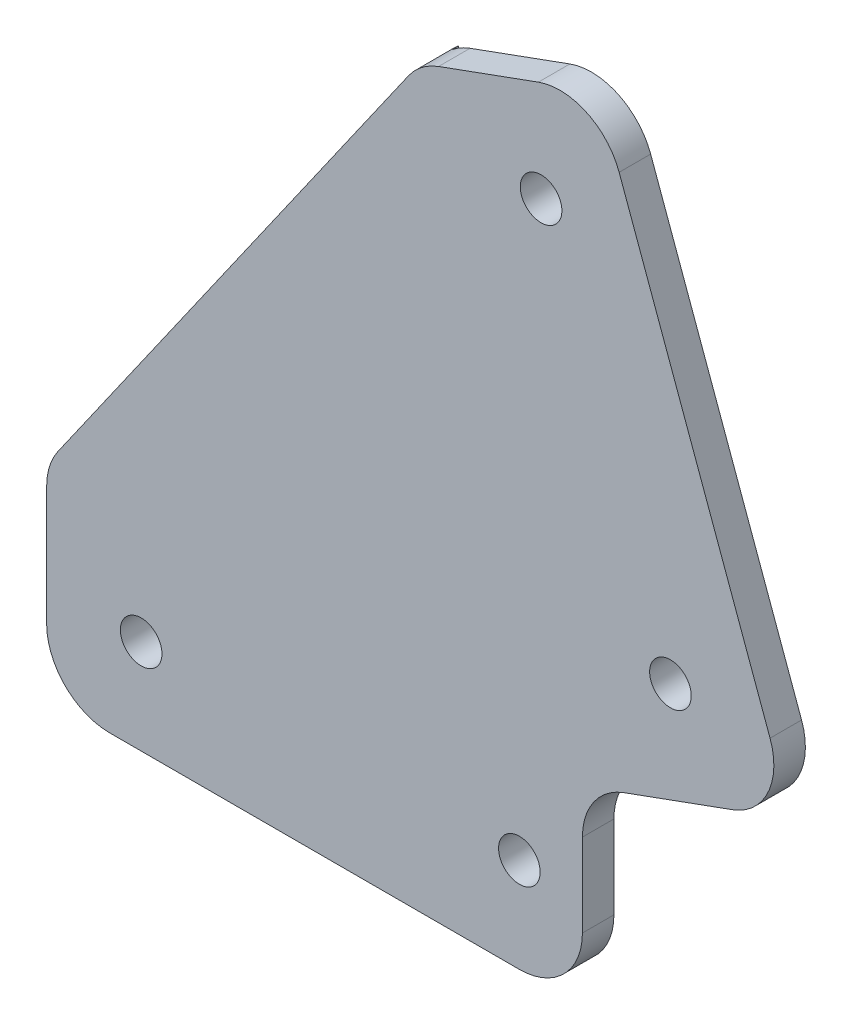
ISO-10303-21;
HEADER;
FILE_DESCRIPTION(('STEP AP214'),'2;1');
FILE_NAME('part.step','',(''),(''),'','','');
FILE_SCHEMA(('AUTOMOTIVE_DESIGN { 1 0 10303 214 1 1 1 1 }'));
ENDSEC;
DATA;
#1=APPLICATION_CONTEXT('core data for automotive mechanical design processes');
#2=APPLICATION_PROTOCOL_DEFINITION('international standard','automotive_design',2000,#1);
#3=PRODUCT_CONTEXT('',#1,'mechanical');
#4=PRODUCT('Part','Part','',(#3));
#5=PRODUCT_RELATED_PRODUCT_CATEGORY('part','',(#4));
#6=PRODUCT_DEFINITION_FORMATION('','',#4);
#7=PRODUCT_DEFINITION_CONTEXT('part definition',#1,'design');
#8=PRODUCT_DEFINITION('design','',#6,#7);
#9=PRODUCT_DEFINITION_SHAPE('','',#8);
#10=(LENGTH_UNIT() NAMED_UNIT(*) SI_UNIT(.MILLI.,.METRE.));
#11=(NAMED_UNIT(*) PLANE_ANGLE_UNIT() SI_UNIT($,.RADIAN.));
#12=(NAMED_UNIT(*) SI_UNIT($,.STERADIAN.) SOLID_ANGLE_UNIT());
#13=UNCERTAINTY_MEASURE_WITH_UNIT(LENGTH_MEASURE(1.E-05),#10,'distance_accuracy_value','');
#14=(GEOMETRIC_REPRESENTATION_CONTEXT(3) GLOBAL_UNCERTAINTY_ASSIGNED_CONTEXT((#13)) GLOBAL_UNIT_ASSIGNED_CONTEXT((#10,
#11,#12)) REPRESENTATION_CONTEXT('',''));
#15=CARTESIAN_POINT('',(0.,0.,0.));
#16=DIRECTION('',(0.,0.,1.));
#17=DIRECTION('',(1.,0.,0.));
#18=AXIS2_PLACEMENT_3D('',#15,#16,#17);
#19=CARTESIAN_POINT('',(51.4702225138264,-141.41327413104,-3.));
#20=DIRECTION('',(0.342020143325674,-0.939692620785906,0.));
#21=DIRECTION('',(0.939692620785907,0.342020143325674,0.));
#22=AXIS2_PLACEMENT_3D('',#19,#20,#21);
#23=PLANE('',#22);
#24=DIRECTION('',(0.,0.,1.));
#25=VECTOR('',#24,1.);
#26=CARTESIAN_POINT('',(449.396926207859,3.42020143325676,-3.));
#27=LINE('',#26,#25);
#28=CARTESIAN_POINT('',(449.396926207859,3.42020143325675,0.));
#29=VERTEX_POINT('',#28);
#30=CARTESIAN_POINT('',(449.396926207859,3.42020143325676,-2.5));
#31=VERTEX_POINT('',#30);
#32=EDGE_CURVE('E258',#29,#31,#27,.F.);
#33=ORIENTED_EDGE('',*,*,#32,.F.);
#34=DIRECTION('',(-0.939692620785907,-0.342020143325674,0.));
#35=VECTOR('',#34,1.);
#36=CARTESIAN_POINT('',(51.4702225138264,-141.41327413104,0.));
#37=LINE('',#36,#35);
#38=CARTESIAN_POINT('',(440.789899283372,0.287499827215487,0.));
#39=VERTEX_POINT('',#38);
#40=EDGE_CURVE('E262',#29,#39,#37,.T.);
#41=ORIENTED_EDGE('',*,*,#40,.T.);
#42=DIRECTION('',(0.,0.,1.));
#43=VECTOR('',#42,1.);
#44=CARTESIAN_POINT('',(440.789899283372,0.287499827215478,0.));
#45=LINE('',#44,#43);
#46=CARTESIAN_POINT('',(440.789899283372,0.287499827215487,-2.5));
#47=VERTEX_POINT('',#46);
#48=EDGE_CURVE('E281',#47,#39,#45,.T.);
#49=ORIENTED_EDGE('',*,*,#48,.F.);
#50=DIRECTION('',(-0.939692620785907,-0.342020143325674,0.));
#51=VECTOR('',#50,1.);
#52=CARTESIAN_POINT('',(51.4702225138264,-141.41327413104,-2.5));
#53=LINE('',#52,#51);
#54=EDGE_CURVE('E229',#31,#47,#53,.T.);
#55=ORIENTED_EDGE('',*,*,#54,.F.);
#56=EDGE_LOOP('',(#33,#41,#49,#55));
#57=FACE_BOUND('',#56,.T.);
#58=ADVANCED_FACE('F43',(#57),#23,.T.);
#59=CARTESIAN_POINT('',(402.625166797963,146.543576280925,-3.));
#60=DIRECTION('',(-0.939692620785907,-0.342020143325672,0.));
#61=DIRECTION('',(0.342020143325672,-0.939692620785907,0.));
#62=AXIS2_PLACEMENT_3D('',#59,#60,#61);
#63=PLANE('',#62);
#64=DIRECTION('',(-0.342020143325672,0.939692620785907,0.));
#65=VECTOR('',#64,1.);
#66=CARTESIAN_POINT('',(438.704482862133,47.416470085251,-2.5));
#67=LINE('',#66,#65);
#68=CARTESIAN_POINT('',(452.38528859516,9.82876525381463,-2.5));
#69=VERTEX_POINT('',#68);
#70=CARTESIAN_POINT('',(440.414583578762,42.7180069813214,-2.5));
#71=VERTEX_POINT('',#70);
#72=EDGE_CURVE('E210',#69,#71,#67,.T.);
#73=ORIENTED_EDGE('',*,*,#72,.T.);
#74=DIRECTION('',(0.,0.,1.));
#75=VECTOR('',#74,1.);
#76=CARTESIAN_POINT('',(440.414583578762,42.7180069813214,-3.));
#77=LINE('',#76,#75);
#78=CARTESIAN_POINT('',(440.414583578762,42.7180069813214,0.));
#79=VERTEX_POINT('',#78);
#80=EDGE_CURVE('E289',#79,#71,#77,.F.);
#81=ORIENTED_EDGE('',*,*,#80,.F.);
#82=DIRECTION('',(-0.342020143325672,0.939692620785907,0.));
#83=VECTOR('',#82,1.);
#84=CARTESIAN_POINT('',(402.625166797963,146.543576280925,0.));
#85=LINE('',#84,#83);
#86=CARTESIAN_POINT('',(452.38528859516,9.82876525381463,0.));
#87=VERTEX_POINT('',#86);
#88=EDGE_CURVE('E265',#87,#79,#85,.T.);
#89=ORIENTED_EDGE('',*,*,#88,.F.);
#90=DIRECTION('',(0.,0.,1.));
#91=VECTOR('',#90,1.);
#92=CARTESIAN_POINT('',(452.38528859516,9.82876525381463,0.));
#93=LINE('',#92,#91);
#94=EDGE_CURVE('E292',#69,#87,#93,.T.);
#95=ORIENTED_EDGE('',*,*,#94,.F.);
#96=EDGE_LOOP('',(#73,#81,#89,#95));
#97=FACE_BOUND('',#96,.T.);
#98=ADVANCED_FACE('F385',(#97),#63,.F.);
#99=CARTESIAN_POINT('',(36.0793160641703,-99.1271061956736,-3.));
#100=DIRECTION('',(-0.342020143325671,0.939692620785908,0.));
#101=DIRECTION('',(-0.939692620785908,-0.342020143325671,0.));
#102=AXIS2_PLACEMENT_3D('',#99,#100,#101);
#103=PLANE('',#102);
#104=DIRECTION('',(0.,0.,1.));
#105=VECTOR('',#104,1.);
#106=CARTESIAN_POINT('',(426.090513276606,42.8253606201798,-3.));
#107=LINE('',#106,#105);
#108=CARTESIAN_POINT('',(426.090513276606,42.8253606201799,0.));
#109=VERTEX_POINT('',#108);
#110=CARTESIAN_POINT('',(426.090513276606,42.8253606201798,-2.5));
#111=VERTEX_POINT('',#110);
#112=EDGE_CURVE('E322',#109,#111,#107,.F.);
#113=ORIENTED_EDGE('',*,*,#112,.F.);
#114=DIRECTION('',(0.939692620785908,0.342020143325671,0.));
#115=VECTOR('',#114,1.);
#116=CARTESIAN_POINT('',(36.0793160641703,-99.1271061956736,0.));
#117=LINE('',#116,#115);
#118=CARTESIAN_POINT('',(434.006019758204,45.7063693686227,0.));
#119=VERTEX_POINT('',#118);
#120=EDGE_CURVE('E268',#109,#119,#117,.T.);
#121=ORIENTED_EDGE('',*,*,#120,.T.);
#122=DIRECTION('',(0.,0.,1.));
#123=VECTOR('',#122,1.);
#124=CARTESIAN_POINT('',(434.006019758204,45.7063693686226,0.));
#125=LINE('',#124,#123);
#126=CARTESIAN_POINT('',(434.006019758204,45.7063693686226,-2.5));
#127=VERTEX_POINT('',#126);
#128=EDGE_CURVE('E325',#127,#119,#125,.T.);
#129=ORIENTED_EDGE('',*,*,#128,.F.);
#130=DIRECTION('',(-0.939692620785907,-0.342020143325672,0.));
#131=VECTOR('',#130,1.);
#132=CARTESIAN_POINT('',(438.704482862133,47.416470085251,-2.5));
#133=LINE('',#132,#131);
#134=EDGE_CURVE('E197',#127,#111,#133,.T.);
#135=ORIENTED_EDGE('',*,*,#134,.T.);
#136=EDGE_LOOP('',(#113,#121,#129,#135));
#137=FACE_BOUND('',#136,.T.);
#138=ADVANCED_FACE('F378',(#137),#103,.T.);
#139=CARTESIAN_POINT('',(444.482543580952,9.61284573083691,0.));
#140=DIRECTION('',(0.,0.,-1.));
#141=DIRECTION('',(1.,0.,0.));
#142=AXIS2_PLACEMENT_3D('',#139,#140,#141);
#143=CYLINDRICAL_SURFACE('',#142,1.64999999999999);
#144=CARTESIAN_POINT('',(444.482543580952,9.61284573083691,0.));
#145=DIRECTION('',(0.,0.,1.));
#146=DIRECTION('',(1.,0.,0.));
#147=AXIS2_PLACEMENT_3D('',#144,#145,#146);
#148=CIRCLE('',#147,1.64999999999999);
#149=CARTESIAN_POINT('',(446.132543580952,9.61284573083691,0.));
#150=VERTEX_POINT('',#149);
#151=EDGE_CURVE('E242',#150,#150,#148,.T.);
#152=ORIENTED_EDGE('',*,*,#151,.T.);
#153=EDGE_LOOP('',(#152));
#154=FACE_BOUND('',#153,.T.);
#155=CARTESIAN_POINT('',(444.482543580952,9.61284573083691,-2.5));
#156=DIRECTION('',(0.,0.,1.));
#157=DIRECTION('',(1.,0.,0.));
#158=AXIS2_PLACEMENT_3D('',#155,#156,#157);
#159=CIRCLE('',#158,1.64999999999999);
#160=CARTESIAN_POINT('',(446.132543580952,9.61284573083691,-2.5));
#161=VERTEX_POINT('',#160);
#162=EDGE_CURVE('E237',#161,#161,#159,.F.);
#163=ORIENTED_EDGE('',*,*,#162,.T.);
#164=EDGE_LOOP('',(#163));
#165=FACE_BOUND('',#164,.T.);
#166=ADVANCED_FACE('F396',(#154,#165),#143,.F.);
#167=CARTESIAN_POINT('',(434.221939281182,37.8036243544141,0.));
#168=DIRECTION('',(0.,0.,-1.));
#169=DIRECTION('',(1.,0.,0.));
#170=AXIS2_PLACEMENT_3D('',#167,#168,#169);
#171=CYLINDRICAL_SURFACE('',#170,1.64999999999999);
#172=CARTESIAN_POINT('',(434.221939281182,37.8036243544141,0.));
#173=DIRECTION('',(0.,0.,1.));
#174=DIRECTION('',(1.,0.,0.));
#175=AXIS2_PLACEMENT_3D('',#172,#173,#174);
#176=CIRCLE('',#175,1.64999999999999);
#177=CARTESIAN_POINT('',(435.871939281182,37.8036243544141,0.));
#178=VERTEX_POINT('',#177);
#179=EDGE_CURVE('E250',#178,#178,#176,.T.);
#180=ORIENTED_EDGE('',*,*,#179,.T.);
#181=EDGE_LOOP('',(#180));
#182=FACE_BOUND('',#181,.T.);
#183=CARTESIAN_POINT('',(434.221939281182,37.8036243544141,-2.5));
#184=DIRECTION('',(0.,0.,1.));
#185=DIRECTION('',(1.,0.,0.));
#186=AXIS2_PLACEMENT_3D('',#183,#184,#185);
#187=CIRCLE('',#186,1.64999999999999);
#188=CARTESIAN_POINT('',(435.871939281182,37.8036243544141,-2.5));
#189=VERTEX_POINT('',#188);
#190=EDGE_CURVE('E234',#189,#189,#187,.F.);
#191=ORIENTED_EDGE('',*,*,#190,.T.);
#192=EDGE_LOOP('',(#191));
#193=FACE_BOUND('',#192,.T.);
#194=ADVANCED_FACE('F389',(#182,#193),#171,.F.);
#195=CARTESIAN_POINT('',(447.686825491231,8.11866453718629,-3.));
#196=DIRECTION('',(0.,0.,-1.));
#197=DIRECTION('',(1.,0.,0.));
#198=AXIS2_PLACEMENT_3D('',#195,#196,#197);
#199=CYLINDRICAL_SURFACE('',#198,5.);
#200=ORIENTED_EDGE('',*,*,#94,.T.);
#201=CARTESIAN_POINT('',(447.686825491231,8.11866453718629,0.));
#202=DIRECTION('',(0.,0.,1.));
#203=DIRECTION('',(1.,0.,0.));
#204=AXIS2_PLACEMENT_3D('',#201,#202,#203);
#205=CIRCLE('',#204,5.);
#206=EDGE_CURVE('E305',#87,#29,#205,.F.);
#207=ORIENTED_EDGE('',*,*,#206,.T.);
#208=ORIENTED_EDGE('',*,*,#32,.T.);
#209=CARTESIAN_POINT('',(447.686825491231,8.11866453718629,-2.5));
#210=DIRECTION('',(0.,0.,1.));
#211=DIRECTION('',(1.,0.,0.));
#212=AXIS2_PLACEMENT_3D('',#209,#210,#211);
#213=CIRCLE('',#212,5.);
#214=EDGE_CURVE('E227',#69,#31,#213,.F.);
#215=ORIENTED_EDGE('',*,*,#214,.F.);
#216=EDGE_LOOP('',(#200,#207,#208,#215));
#217=FACE_BOUND('',#216,.T.);
#218=ADVANCED_FACE('F387',(#217),#199,.T.);
#219=CARTESIAN_POINT('',(435.716120474832,41.0079062646931,-3.));
#220=DIRECTION('',(0.,0.,-1.));
#221=DIRECTION('',(1.,0.,0.));
#222=AXIS2_PLACEMENT_3D('',#219,#220,#221);
#223=CYLINDRICAL_SURFACE('',#222,5.);
#224=ORIENTED_EDGE('',*,*,#128,.T.);
#225=CARTESIAN_POINT('',(435.716120474832,41.0079062646931,0.));
#226=DIRECTION('',(0.,0.,1.));
#227=DIRECTION('',(1.,0.,0.));
#228=AXIS2_PLACEMENT_3D('',#225,#226,#227);
#229=CIRCLE('',#228,5.);
#230=EDGE_CURVE('E301',#119,#79,#229,.F.);
#231=ORIENTED_EDGE('',*,*,#230,.T.);
#232=ORIENTED_EDGE('',*,*,#80,.T.);
#233=CARTESIAN_POINT('',(435.716120474832,41.0079062646931,-2.5));
#234=DIRECTION('',(0.,0.,1.));
#235=DIRECTION('',(1.,0.,0.));
#236=AXIS2_PLACEMENT_3D('',#233,#234,#235);
#237=CIRCLE('',#236,5.);
#238=EDGE_CURVE('E179',#127,#71,#237,.F.);
#239=ORIENTED_EDGE('',*,*,#238,.F.);
#240=EDGE_LOOP('',(#224,#231,#232,#239));
#241=FACE_BOUND('',#240,.T.);
#242=ADVANCED_FACE('F381',(#241),#223,.T.);
#243=CARTESIAN_POINT('',(437.5,0.,-3.));
#244=DIRECTION('',(1.,0.,0.));
#245=DIRECTION('',(0.,0.,1.));
#246=AXIS2_PLACEMENT_3D('',#243,#244,#245);
#247=PLANE('',#246);
#248=DIRECTION('',(0.,1.,0.));
#249=VECTOR('',#248,1.);
#250=CARTESIAN_POINT('',(437.5,0.,-2.5));
#251=LINE('',#250,#249);
#252=CARTESIAN_POINT('',(437.5,-11.0000000000001,-2.5));
#253=VERTEX_POINT('',#252);
#254=CARTESIAN_POINT('',(437.5,-4.41096327671406,-2.5));
#255=VERTEX_POINT('',#254);
#256=EDGE_CURVE('E212',#253,#255,#251,.T.);
#257=ORIENTED_EDGE('',*,*,#256,.T.);
#258=DIRECTION('',(0.,0.,1.));
#259=VECTOR('',#258,1.);
#260=CARTESIAN_POINT('',(437.5,-4.41096327671406,-3.));
#261=LINE('',#260,#259);
#262=CARTESIAN_POINT('',(437.5,-4.41096327671406,0.));
#263=VERTEX_POINT('',#262);
#264=EDGE_CURVE('E287',#263,#255,#261,.F.);
#265=ORIENTED_EDGE('',*,*,#264,.F.);
#266=DIRECTION('',(0.,-1.,0.));
#267=VECTOR('',#266,1.);
#268=CARTESIAN_POINT('',(437.5,0.,0.));
#269=LINE('',#268,#267);
#270=CARTESIAN_POINT('',(437.5,-11.0000000000001,0.));
#271=VERTEX_POINT('',#270);
#272=EDGE_CURVE('E246',#263,#271,#269,.T.);
#273=ORIENTED_EDGE('',*,*,#272,.T.);
#274=DIRECTION('',(0.,0.,1.));
#275=VECTOR('',#274,1.);
#276=CARTESIAN_POINT('',(437.5,-11.0000000000001,-3.));
#277=LINE('',#276,#275);
#278=EDGE_CURVE('E284',#253,#271,#277,.T.);
#279=ORIENTED_EDGE('',*,*,#278,.F.);
#280=EDGE_LOOP('',(#257,#265,#273,#279));
#281=FACE_BOUND('',#280,.T.);
#282=ADVANCED_FACE('F367',(#281),#247,.T.);
#283=CARTESIAN_POINT('',(265.048978306821,-185.589292605216,-3.));
#284=DIRECTION('',(0.819152044288994,-0.573576436351042,0.));
#285=DIRECTION('',(0.573576436351042,0.819152044288994,0.));
#286=AXIS2_PLACEMENT_3D('',#283,#284,#285);
#287=PLANE('',#286);
#288=DIRECTION('',(-0.573576436351042,-0.819152044288994,0.));
#289=VECTOR('',#288,1.);
#290=CARTESIAN_POINT('',(265.048978306821,-185.589292605216,-3.));
#291=LINE('',#290,#289);
#292=CARTESIAN_POINT('',(423.704853771789,40.9947796980054,-3.));
#293=VERTEX_POINT('',#292);
#294=CARTESIAN_POINT('',(395.904239778555,1.29138823736039,-3.));
#295=VERTEX_POINT('',#294);
#296=EDGE_CURVE('E255',#293,#295,#291,.T.);
#297=ORIENTED_EDGE('',*,*,#296,.T.);
#298=DIRECTION('',(0.,0.,1.));
#299=VECTOR('',#298,1.);
#300=CARTESIAN_POINT('',(395.904239778555,1.29138823736039,-3.));
#301=LINE('',#300,#299);
#302=CARTESIAN_POINT('',(395.904239778555,1.29138823736039,0.));
#303=VERTEX_POINT('',#302);
#304=EDGE_CURVE('E328',#303,#295,#301,.F.);
#305=ORIENTED_EDGE('',*,*,#304,.F.);
#306=DIRECTION('',(-0.573576436351042,-0.819152044288994,0.));
#307=VECTOR('',#306,1.);
#308=CARTESIAN_POINT('',(265.048978306821,-185.589292605216,0.));
#309=LINE('',#308,#307);
#310=CARTESIAN_POINT('',(423.704853771789,40.9947796980054,0.));
#311=VERTEX_POINT('',#310);
#312=EDGE_CURVE('E271',#311,#303,#309,.T.);
#313=ORIENTED_EDGE('',*,*,#312,.F.);
#314=DIRECTION('',(0.,0.,1.));
#315=VECTOR('',#314,1.);
#316=CARTESIAN_POINT('',(423.704853771789,40.9947796980055,0.));
#317=LINE('',#316,#315);
#318=EDGE_CURVE('E331',#293,#311,#317,.T.);
#319=ORIENTED_EDGE('',*,*,#318,.F.);
#320=EDGE_LOOP('',(#297,#305,#313,#319));
#321=FACE_BOUND('',#320,.T.);
#322=ADVANCED_FACE('F344',(#321),#287,.F.);
#323=CARTESIAN_POINT('',(395.,0.,-3.));
#324=DIRECTION('',(1.,0.,0.));
#325=DIRECTION('',(0.,0.,1.));
#326=AXIS2_PLACEMENT_3D('',#323,#324,#325);
#327=PLANE('',#326);
#328=DIRECTION('',(0.,0.,1.));
#329=VECTOR('',#328,1.);
#330=CARTESIAN_POINT('',(395.,-11.,-3.));
#331=LINE('',#330,#329);
#332=CARTESIAN_POINT('',(395.,-11.,0.));
#333=VERTEX_POINT('',#332);
#334=CARTESIAN_POINT('',(395.,-11.,-2.5));
#335=VERTEX_POINT('',#334);
#336=EDGE_CURVE('E319',#333,#335,#331,.F.);
#337=ORIENTED_EDGE('',*,*,#336,.F.);
#338=DIRECTION('',(0.,-1.,0.));
#339=VECTOR('',#338,1.);
#340=CARTESIAN_POINT('',(395.,0.,0.));
#341=LINE('',#340,#339);
#342=CARTESIAN_POINT('',(395.,-1.57649394439481,0.));
#343=VERTEX_POINT('',#342);
#344=EDGE_CURVE('E274',#343,#333,#341,.T.);
#345=ORIENTED_EDGE('',*,*,#344,.F.);
#346=DIRECTION('',(0.,0.,1.));
#347=VECTOR('',#346,1.);
#348=CARTESIAN_POINT('',(395.,-1.57649394439481,-3.));
#349=LINE('',#348,#347);
#350=CARTESIAN_POINT('',(395.,-1.57649394439481,-2.5));
#351=VERTEX_POINT('',#350);
#352=EDGE_CURVE('E316',#351,#343,#349,.T.);
#353=ORIENTED_EDGE('',*,*,#352,.F.);
#354=DIRECTION('',(0.,-1.,0.));
#355=VECTOR('',#354,1.);
#356=CARTESIAN_POINT('',(395.,-16.0000000000001,-2.5));
#357=LINE('',#356,#355);
#358=EDGE_CURVE('E195',#351,#335,#357,.T.);
#359=ORIENTED_EDGE('',*,*,#358,.T.);
#360=EDGE_LOOP('',(#337,#345,#353,#359));
#361=FACE_BOUND('',#360,.T.);
#362=ADVANCED_FACE('F374',(#361),#327,.F.);
#363=CARTESIAN_POINT('',(0.,-15.9999999999991,-3.));
#364=DIRECTION('',(0.,-1.,0.));
#365=DIRECTION('',(1.,0.,0.));
#366=AXIS2_PLACEMENT_3D('',#363,#364,#365);
#367=PLANE('',#366);
#368=DIRECTION('',(1.,0.,0.));
#369=VECTOR('',#368,1.);
#370=CARTESIAN_POINT('',(395.,-16.0000000000001,-2.5));
#371=LINE('',#370,#369);
#372=CARTESIAN_POINT('',(400.,-16.0000000000001,-2.5));
#373=VERTEX_POINT('',#372);
#374=CARTESIAN_POINT('',(432.5,-16.0000000000001,-2.5));
#375=VERTEX_POINT('',#374);
#376=EDGE_CURVE('E200',#373,#375,#371,.T.);
#377=ORIENTED_EDGE('',*,*,#376,.T.);
#378=DIRECTION('',(0.,0.,1.));
#379=VECTOR('',#378,1.);
#380=CARTESIAN_POINT('',(432.5,-16.0000000000001,-3.));
#381=LINE('',#380,#379);
#382=CARTESIAN_POINT('',(432.5,-16.0000000000001,0.));
#383=VERTEX_POINT('',#382);
#384=EDGE_CURVE('E311',#383,#375,#381,.F.);
#385=ORIENTED_EDGE('',*,*,#384,.F.);
#386=DIRECTION('',(-1.,0.,0.));
#387=VECTOR('',#386,1.);
#388=CARTESIAN_POINT('',(0.,-15.9999999999991,0.));
#389=LINE('',#388,#387);
#390=CARTESIAN_POINT('',(400.,-16.,0.));
#391=VERTEX_POINT('',#390);
#392=EDGE_CURVE('E259',#383,#391,#389,.T.);
#393=ORIENTED_EDGE('',*,*,#392,.T.);
#394=DIRECTION('',(0.,0.,1.));
#395=VECTOR('',#394,1.);
#396=CARTESIAN_POINT('',(400.,-16.,0.));
#397=LINE('',#396,#395);
#398=EDGE_CURVE('E313',#373,#391,#397,.T.);
#399=ORIENTED_EDGE('',*,*,#398,.F.);
#400=EDGE_LOOP('',(#377,#385,#393,#399));
#401=FACE_BOUND('',#400,.T.);
#402=ADVANCED_FACE('F436',(#401),#367,.T.);
#403=CARTESIAN_POINT('',(0.,0.,-3.));
#404=DIRECTION('',(0.,0.,-1.));
#405=DIRECTION('',(1.,0.,0.));
#406=AXIS2_PLACEMENT_3D('',#403,#404,#405);
#407=PLANE('',#406);
#408=DIRECTION('',(-1.,0.,0.));
#409=VECTOR('',#408,1.);
#410=CARTESIAN_POINT('',(395.,-0.950000000000086,-3.));
#411=LINE('',#410,#409);
#412=CARTESIAN_POINT('',(438.891436130919,-0.950000000000078,-3.));
#413=VERTEX_POINT('',#412);
#414=CARTESIAN_POINT('',(395.039404739587,-0.950000000000086,-3.));
#415=VERTEX_POINT('',#414);
#416=EDGE_CURVE('E185',#413,#415,#411,.T.);
#417=ORIENTED_EDGE('',*,*,#416,.T.);
#418=CARTESIAN_POINT('',(400.,-1.57649394439481,-3.));
#419=DIRECTION('',(0.,0.,1.));
#420=DIRECTION('',(1.,0.,0.));
#421=AXIS2_PLACEMENT_3D('',#418,#419,#420);
#422=CIRCLE('',#421,5.);
#423=EDGE_CURVE('E307',#295,#415,#422,.T.);
#424=ORIENTED_EDGE('',*,*,#423,.F.);
#425=ORIENTED_EDGE('',*,*,#296,.F.);
#426=CARTESIAN_POINT('',(427.800613993234,38.1268975162503,-3.));
#427=DIRECTION('',(0.,0.,1.));
#428=DIRECTION('',(1.,0.,0.));
#429=AXIS2_PLACEMENT_3D('',#426,#427,#428);
#430=CIRCLE('',#429,5.);
#431=CARTESIAN_POINT('',(424.655119103751,42.0135235466566,-3.));
#432=VERTEX_POINT('',#431);
#433=EDGE_CURVE('E309',#432,#293,#430,.T.);
#434=ORIENTED_EDGE('',*,*,#433,.F.);
#435=DIRECTION('',(0.342020143325672,-0.939692620785907,0.));
#436=VECTOR('',#435,1.);
#437=CARTESIAN_POINT('',(424.562108919305,42.2690669281996,-3.));
#438=LINE('',#437,#436);
#439=CARTESIAN_POINT('',(439.980361560203,-0.0922340501130058,-3.));
#440=VERTEX_POINT('',#439);
#441=EDGE_CURVE('E188',#432,#440,#438,.T.);
#442=ORIENTED_EDGE('',*,*,#441,.T.);
#443=CARTESIAN_POINT('',(442.5,-4.41096327671406,-3.));
#444=DIRECTION('',(0.,0.,1.));
#445=DIRECTION('',(1.,0.,0.));
#446=AXIS2_PLACEMENT_3D('',#443,#444,#445);
#447=CIRCLE('',#446,5.);
#448=EDGE_CURVE('E173',#413,#440,#447,.F.);
#449=ORIENTED_EDGE('',*,*,#448,.F.);
#450=EDGE_LOOP('',(#417,#424,#425,#434,#442,#449));
#451=FACE_BOUND('',#450,.T.);
#452=ADVANCED_FACE('F184',(#451),#407,.T.);
#453=CARTESIAN_POINT('',(0.,0.,0.));
#454=DIRECTION('',(0.,0.,-1.));
#455=DIRECTION('',(1.,0.,0.));
#456=AXIS2_PLACEMENT_3D('',#453,#454,#455);
#457=PLANE('',#456);
#458=CARTESIAN_POINT('',(402.5,-8.5000000000001,0.));
#459=DIRECTION('',(0.,0.,1.));
#460=DIRECTION('',(1.,0.,0.));
#461=AXIS2_PLACEMENT_3D('',#458,#459,#460);
#462=CIRCLE('',#461,1.64999999999999);
#463=CARTESIAN_POINT('',(404.15,-8.5000000000001,0.));
#464=VERTEX_POINT('',#463);
#465=EDGE_CURVE('E243',#464,#464,#462,.T.);
#466=ORIENTED_EDGE('',*,*,#465,.F.);
#467=EDGE_LOOP('',(#466));
#468=FACE_BOUND('',#467,.T.);
#469=CARTESIAN_POINT('',(432.5,-8.5000000000001,0.));
#470=DIRECTION('',(0.,0.,1.));
#471=DIRECTION('',(1.,0.,0.));
#472=AXIS2_PLACEMENT_3D('',#469,#470,#471);
#473=CIRCLE('',#472,1.64999999999999);
#474=CARTESIAN_POINT('',(434.15,-8.5000000000001,0.));
#475=VERTEX_POINT('',#474);
#476=EDGE_CURVE('E247',#475,#475,#473,.T.);
#477=ORIENTED_EDGE('',*,*,#476,.F.);
#478=EDGE_LOOP('',(#477));
#479=FACE_BOUND('',#478,.T.);
#480=ORIENTED_EDGE('',*,*,#179,.F.);
#481=EDGE_LOOP('',(#480));
#482=FACE_BOUND('',#481,.T.);
#483=ORIENTED_EDGE('',*,*,#151,.F.);
#484=EDGE_LOOP('',(#483));
#485=FACE_BOUND('',#484,.T.);
#486=ORIENTED_EDGE('',*,*,#88,.T.);
#487=ORIENTED_EDGE('',*,*,#230,.F.);
#488=ORIENTED_EDGE('',*,*,#120,.F.);
#489=CARTESIAN_POINT('',(427.800613993234,38.1268975162503,0.));
#490=DIRECTION('',(0.,0.,1.));
#491=DIRECTION('',(1.,0.,0.));
#492=AXIS2_PLACEMENT_3D('',#489,#490,#491);
#493=CIRCLE('',#492,5.);
#494=EDGE_CURVE('E299',#311,#109,#493,.F.);
#495=ORIENTED_EDGE('',*,*,#494,.F.);
#496=ORIENTED_EDGE('',*,*,#312,.T.);
#497=CARTESIAN_POINT('',(400.,-1.57649394439481,0.));
#498=DIRECTION('',(0.,0.,1.));
#499=DIRECTION('',(1.,0.,0.));
#500=AXIS2_PLACEMENT_3D('',#497,#498,#499);
#501=CIRCLE('',#500,5.);
#502=EDGE_CURVE('E297',#343,#303,#501,.F.);
#503=ORIENTED_EDGE('',*,*,#502,.F.);
#504=ORIENTED_EDGE('',*,*,#344,.T.);
#505=CARTESIAN_POINT('',(400.,-11.,0.));
#506=DIRECTION('',(0.,0.,1.));
#507=DIRECTION('',(1.,0.,0.));
#508=AXIS2_PLACEMENT_3D('',#505,#506,#507);
#509=CIRCLE('',#508,5.);
#510=EDGE_CURVE('E303',#391,#333,#509,.F.);
#511=ORIENTED_EDGE('',*,*,#510,.F.);
#512=ORIENTED_EDGE('',*,*,#392,.F.);
#513=CARTESIAN_POINT('',(432.5,-11.0000000000001,0.));
#514=DIRECTION('',(0.,0.,1.));
#515=DIRECTION('',(1.,0.,0.));
#516=AXIS2_PLACEMENT_3D('',#513,#514,#515);
#517=CIRCLE('',#516,5.);
#518=EDGE_CURVE('E295',#271,#383,#517,.F.);
#519=ORIENTED_EDGE('',*,*,#518,.F.);
#520=ORIENTED_EDGE('',*,*,#272,.F.);
#521=CARTESIAN_POINT('',(442.5,-4.41096327671406,0.));
#522=DIRECTION('',(0.,0.,1.));
#523=DIRECTION('',(1.,0.,0.));
#524=AXIS2_PLACEMENT_3D('',#521,#522,#523);
#525=CIRCLE('',#524,5.);
#526=EDGE_CURVE('E189',#39,#263,#525,.T.);
#527=ORIENTED_EDGE('',*,*,#526,.F.);
#528=ORIENTED_EDGE('',*,*,#40,.F.);
#529=ORIENTED_EDGE('',*,*,#206,.F.);
#530=EDGE_LOOP('',(#486,#487,#488,#495,#496,#503,#504,#511,#512,#519,#520,#527,#528,#529));
#531=FACE_BOUND('',#530,.T.);
#532=ADVANCED_FACE('F362',(#468,#479,#482,#485,#531),#457,.F.);
#533=CARTESIAN_POINT('',(432.5,-8.5000000000001,0.));
#534=DIRECTION('',(0.,0.,-1.));
#535=DIRECTION('',(1.,0.,0.));
#536=AXIS2_PLACEMENT_3D('',#533,#534,#535);
#537=CYLINDRICAL_SURFACE('',#536,1.64999999999999);
#538=CARTESIAN_POINT('',(432.5,-8.5000000000001,-2.5));
#539=DIRECTION('',(0.,0.,-1.));
#540=DIRECTION('',(-1.,0.,0.));
#541=AXIS2_PLACEMENT_3D('',#538,#539,#540);
#542=CIRCLE('',#541,1.64999999999999);
#543=CARTESIAN_POINT('',(430.85,-8.5000000000001,-2.5));
#544=VERTEX_POINT('',#543);
#545=EDGE_CURVE('E180',#544,#544,#542,.F.);
#546=ORIENTED_EDGE('',*,*,#545,.F.);
#547=EDGE_LOOP('',(#546));
#548=FACE_BOUND('',#547,.T.);
#549=ORIENTED_EDGE('',*,*,#476,.T.);
#550=EDGE_LOOP('',(#549));
#551=FACE_BOUND('',#550,.T.);
#552=ADVANCED_FACE('F418',(#548,#551),#537,.F.);
#553=CARTESIAN_POINT('',(402.5,-8.5000000000001,0.));
#554=DIRECTION('',(0.,0.,-1.));
#555=DIRECTION('',(1.,0.,0.));
#556=AXIS2_PLACEMENT_3D('',#553,#554,#555);
#557=CYLINDRICAL_SURFACE('',#556,1.64999999999999);
#558=CARTESIAN_POINT('',(402.5,-8.5000000000001,-2.5));
#559=DIRECTION('',(0.,0.,-1.));
#560=DIRECTION('',(-1.,0.,0.));
#561=AXIS2_PLACEMENT_3D('',#558,#559,#560);
#562=CIRCLE('',#561,1.64999999999999);
#563=CARTESIAN_POINT('',(400.85,-8.5000000000001,-2.5));
#564=VERTEX_POINT('',#563);
#565=EDGE_CURVE('E221',#564,#564,#562,.F.);
#566=ORIENTED_EDGE('',*,*,#565,.F.);
#567=EDGE_LOOP('',(#566));
#568=FACE_BOUND('',#567,.T.);
#569=ORIENTED_EDGE('',*,*,#465,.T.);
#570=EDGE_LOOP('',(#569));
#571=FACE_BOUND('',#570,.T.);
#572=ADVANCED_FACE('F412',(#568,#571),#557,.F.);
#573=CARTESIAN_POINT('',(442.5,-4.41096327671406,-3.));
#574=DIRECTION('',(0.,0.,-1.));
#575=DIRECTION('',(1.,0.,0.));
#576=AXIS2_PLACEMENT_3D('',#573,#574,#575);
#577=CYLINDRICAL_SURFACE('',#576,5.);
#578=ORIENTED_EDGE('',*,*,#448,.T.);
#579=DIRECTION('',(0.,0.,-1.));
#580=VECTOR('',#579,1.);
#581=CARTESIAN_POINT('',(439.980361560203,-0.0922340501130067,-3.));
#582=LINE('',#581,#580);
#583=CARTESIAN_POINT('',(439.980361560203,-0.0922340501130058,-2.5));
#584=VERTEX_POINT('',#583);
#585=EDGE_CURVE('E240',#584,#440,#582,.T.);
#586=ORIENTED_EDGE('',*,*,#585,.F.);
#587=CARTESIAN_POINT('',(442.5,-4.41096327671406,-2.5));
#588=DIRECTION('',(0.,0.,1.));
#589=DIRECTION('',(1.,0.,0.));
#590=AXIS2_PLACEMENT_3D('',#587,#588,#589);
#591=CIRCLE('',#590,5.);
#592=EDGE_CURVE('E232',#584,#47,#591,.F.);
#593=ORIENTED_EDGE('',*,*,#592,.T.);
#594=ORIENTED_EDGE('',*,*,#48,.T.);
#595=ORIENTED_EDGE('',*,*,#526,.T.);
#596=ORIENTED_EDGE('',*,*,#264,.T.);
#597=CARTESIAN_POINT('',(442.5,-4.41096327671406,-2.5));
#598=DIRECTION('',(0.,0.,-1.));
#599=DIRECTION('',(-1.,0.,0.));
#600=AXIS2_PLACEMENT_3D('',#597,#598,#599);
#601=CIRCLE('',#600,5.);
#602=CARTESIAN_POINT('',(438.891436130919,-0.950000000000078,-2.5));
#603=VERTEX_POINT('',#602);
#604=EDGE_CURVE('E176',#603,#255,#601,.F.);
#605=ORIENTED_EDGE('',*,*,#604,.F.);
#606=DIRECTION('',(0.,0.,-1.));
#607=VECTOR('',#606,1.);
#608=CARTESIAN_POINT('',(438.891436130919,-0.950000000000078,-3.));
#609=LINE('',#608,#607);
#610=EDGE_CURVE('E169',#413,#603,#609,.F.);
#611=ORIENTED_EDGE('',*,*,#610,.F.);
#612=EDGE_LOOP('',(#578,#586,#593,#594,#595,#596,#605,#611));
#613=FACE_BOUND('',#612,.T.);
#614=ADVANCED_FACE('F171',(#613),#577,.F.);
#615=CARTESIAN_POINT('',(400.,-11.,-3.));
#616=DIRECTION('',(0.,0.,-1.));
#617=DIRECTION('',(1.,0.,0.));
#618=AXIS2_PLACEMENT_3D('',#615,#616,#617);
#619=CYLINDRICAL_SURFACE('',#618,5.);
#620=CARTESIAN_POINT('',(400.,-11.,-2.5));
#621=DIRECTION('',(0.,0.,-1.));
#622=DIRECTION('',(-1.,0.,0.));
#623=AXIS2_PLACEMENT_3D('',#620,#621,#622);
#624=CIRCLE('',#623,5.);
#625=EDGE_CURVE('E219',#335,#373,#624,.F.);
#626=ORIENTED_EDGE('',*,*,#625,.T.);
#627=ORIENTED_EDGE('',*,*,#398,.T.);
#628=ORIENTED_EDGE('',*,*,#510,.T.);
#629=ORIENTED_EDGE('',*,*,#336,.T.);
#630=EDGE_LOOP('',(#626,#627,#628,#629));
#631=FACE_BOUND('',#630,.T.);
#632=ADVANCED_FACE('F411',(#631),#619,.T.);
#633=CARTESIAN_POINT('',(427.800613993234,38.1268975162503,-3.));
#634=DIRECTION('',(0.,0.,-1.));
#635=DIRECTION('',(1.,0.,0.));
#636=AXIS2_PLACEMENT_3D('',#633,#634,#635);
#637=CYLINDRICAL_SURFACE('',#636,5.);
#638=DIRECTION('',(0.,0.,-1.));
#639=VECTOR('',#638,1.);
#640=CARTESIAN_POINT('',(424.655119103751,42.0135235466566,-3.));
#641=LINE('',#640,#639);
#642=CARTESIAN_POINT('',(424.655119103751,42.0135235466566,-2.5));
#643=VERTEX_POINT('',#642);
#644=EDGE_CURVE('E11',#643,#432,#641,.T.);
#645=ORIENTED_EDGE('',*,*,#644,.T.);
#646=ORIENTED_EDGE('',*,*,#433,.T.);
#647=ORIENTED_EDGE('',*,*,#318,.T.);
#648=ORIENTED_EDGE('',*,*,#494,.T.);
#649=ORIENTED_EDGE('',*,*,#112,.T.);
#650=CARTESIAN_POINT('',(427.800613993234,38.1268975162503,-2.5));
#651=DIRECTION('',(0.,0.,1.));
#652=DIRECTION('',(1.,0.,0.));
#653=AXIS2_PLACEMENT_3D('',#650,#651,#652);
#654=CIRCLE('',#653,5.);
#655=EDGE_CURVE('E51',#643,#111,#654,.F.);
#656=ORIENTED_EDGE('',*,*,#655,.F.);
#657=EDGE_LOOP('',(#645,#646,#647,#648,#649,#656));
#658=FACE_BOUND('',#657,.T.);
#659=ADVANCED_FACE('F347',(#658),#637,.T.);
#660=CARTESIAN_POINT('',(400.,-1.57649394439481,-3.));
#661=DIRECTION('',(0.,0.,1.));
#662=DIRECTION('',(-1.,0.,0.));
#663=AXIS2_PLACEMENT_3D('',#660,#661,#662);
#664=CYLINDRICAL_SURFACE('',#663,5.);
#665=DIRECTION('',(0.,0.,1.));
#666=VECTOR('',#665,1.);
#667=CARTESIAN_POINT('',(395.039404739587,-0.950000000000086,-3.));
#668=LINE('',#667,#666);
#669=CARTESIAN_POINT('',(395.039404739587,-0.950000000000086,-2.5));
#670=VERTEX_POINT('',#669);
#671=EDGE_CURVE('E193',#415,#670,#668,.T.);
#672=ORIENTED_EDGE('',*,*,#671,.T.);
#673=CARTESIAN_POINT('',(400.,-1.57649394439481,-2.5));
#674=DIRECTION('',(0.,0.,-1.));
#675=DIRECTION('',(-1.,0.,0.));
#676=AXIS2_PLACEMENT_3D('',#673,#674,#675);
#677=CIRCLE('',#676,5.);
#678=EDGE_CURVE('E217',#670,#351,#677,.F.);
#679=ORIENTED_EDGE('',*,*,#678,.T.);
#680=ORIENTED_EDGE('',*,*,#352,.T.);
#681=ORIENTED_EDGE('',*,*,#502,.T.);
#682=ORIENTED_EDGE('',*,*,#304,.T.);
#683=ORIENTED_EDGE('',*,*,#423,.T.);
#684=EDGE_LOOP('',(#672,#679,#680,#681,#682,#683));
#685=FACE_BOUND('',#684,.T.);
#686=ADVANCED_FACE('F337',(#685),#664,.T.);
#687=CARTESIAN_POINT('',(432.5,-11.0000000000001,-3.));
#688=DIRECTION('',(0.,0.,1.));
#689=DIRECTION('',(-1.,0.,0.));
#690=AXIS2_PLACEMENT_3D('',#687,#688,#689);
#691=CYLINDRICAL_SURFACE('',#690,5.);
#692=CARTESIAN_POINT('',(432.5,-11.0000000000001,-2.5));
#693=DIRECTION('',(0.,0.,-1.));
#694=DIRECTION('',(-1.,0.,0.));
#695=AXIS2_PLACEMENT_3D('',#692,#693,#694);
#696=CIRCLE('',#695,5.);
#697=EDGE_CURVE('E65',#375,#253,#696,.F.);
#698=ORIENTED_EDGE('',*,*,#697,.T.);
#699=ORIENTED_EDGE('',*,*,#278,.T.);
#700=ORIENTED_EDGE('',*,*,#518,.T.);
#701=ORIENTED_EDGE('',*,*,#384,.T.);
#702=EDGE_LOOP('',(#698,#699,#700,#701));
#703=FACE_BOUND('',#702,.T.);
#704=ADVANCED_FACE('F45',(#703),#691,.T.);
#705=CARTESIAN_POINT('',(395.,-0.950000000000086,-2.5));
#706=DIRECTION('',(0.,1.,0.));
#707=DIRECTION('',(-1.,0.,0.));
#708=AXIS2_PLACEMENT_3D('',#705,#706,#707);
#709=PLANE('',#708);
#710=ORIENTED_EDGE('',*,*,#416,.F.);
#711=ORIENTED_EDGE('',*,*,#610,.T.);
#712=DIRECTION('',(-1.,0.,0.));
#713=VECTOR('',#712,1.);
#714=CARTESIAN_POINT('',(395.,-0.950000000000086,-2.5));
#715=LINE('',#714,#713);
#716=EDGE_CURVE('E203',#603,#670,#715,.T.);
#717=ORIENTED_EDGE('',*,*,#716,.T.);
#718=ORIENTED_EDGE('',*,*,#671,.F.);
#719=EDGE_LOOP('',(#710,#711,#717,#718));
#720=FACE_BOUND('',#719,.T.);
#721=ADVANCED_FACE('F191',(#720),#709,.F.);
#722=CARTESIAN_POINT('',(0.,0.,-2.5));
#723=DIRECTION('',(0.,0.,1.));
#724=DIRECTION('',(-1.,0.,0.));
#725=AXIS2_PLACEMENT_3D('',#722,#723,#724);
#726=PLANE('',#725);
#727=ORIENTED_EDGE('',*,*,#565,.T.);
#728=EDGE_LOOP('',(#727));
#729=FACE_BOUND('',#728,.T.);
#730=ORIENTED_EDGE('',*,*,#625,.F.);
#731=ORIENTED_EDGE('',*,*,#358,.F.);
#732=ORIENTED_EDGE('',*,*,#678,.F.);
#733=ORIENTED_EDGE('',*,*,#716,.F.);
#734=ORIENTED_EDGE('',*,*,#604,.T.);
#735=ORIENTED_EDGE('',*,*,#256,.F.);
#736=ORIENTED_EDGE('',*,*,#697,.F.);
#737=ORIENTED_EDGE('',*,*,#376,.F.);
#738=EDGE_LOOP('',(#730,#731,#732,#733,#734,#735,#736,#737));
#739=FACE_BOUND('',#738,.T.);
#740=ORIENTED_EDGE('',*,*,#545,.T.);
#741=EDGE_LOOP('',(#740));
#742=FACE_BOUND('',#741,.T.);
#743=ADVANCED_FACE('F368',(#729,#739,#742),#726,.F.);
#744=CARTESIAN_POINT('',(424.562108919305,42.2690669281996,-2.5));
#745=DIRECTION('',(-0.939692620785907,-0.342020143325672,0.));
#746=DIRECTION('',(0.342020143325672,-0.939692620785907,0.));
#747=AXIS2_PLACEMENT_3D('',#744,#745,#746);
#748=PLANE('',#747);
#749=DIRECTION('',(0.342020143325672,-0.939692620785907,0.));
#750=VECTOR('',#749,1.);
#751=CARTESIAN_POINT('',(424.562108919305,42.2690669281996,-2.5));
#752=LINE('',#751,#750);
#753=EDGE_CURVE('E208',#643,#584,#752,.T.);
#754=ORIENTED_EDGE('',*,*,#753,.T.);
#755=ORIENTED_EDGE('',*,*,#585,.T.);
#756=ORIENTED_EDGE('',*,*,#441,.F.);
#757=ORIENTED_EDGE('',*,*,#644,.F.);
#758=EDGE_LOOP('',(#754,#755,#756,#757));
#759=FACE_BOUND('',#758,.T.);
#760=ADVANCED_FACE('F351',(#759),#748,.F.);
#761=CARTESIAN_POINT('',(0.,0.,-2.5));
#762=DIRECTION('',(0.,0.,-1.));
#763=DIRECTION('',(1.,0.,0.));
#764=AXIS2_PLACEMENT_3D('',#761,#762,#763);
#765=PLANE('',#764);
#766=ORIENTED_EDGE('',*,*,#592,.F.);
#767=ORIENTED_EDGE('',*,*,#753,.F.);
#768=ORIENTED_EDGE('',*,*,#655,.T.);
#769=ORIENTED_EDGE('',*,*,#134,.F.);
#770=ORIENTED_EDGE('',*,*,#238,.T.);
#771=ORIENTED_EDGE('',*,*,#72,.F.);
#772=ORIENTED_EDGE('',*,*,#214,.T.);
#773=ORIENTED_EDGE('',*,*,#54,.T.);
#774=EDGE_LOOP('',(#766,#767,#768,#769,#770,#771,#772,#773));
#775=FACE_BOUND('',#774,.T.);
#776=ORIENTED_EDGE('',*,*,#190,.F.);
#777=EDGE_LOOP('',(#776));
#778=FACE_BOUND('',#777,.T.);
#779=ORIENTED_EDGE('',*,*,#162,.F.);
#780=EDGE_LOOP('',(#779));
#781=FACE_BOUND('',#780,.T.);
#782=ADVANCED_FACE('F355',(#775,#778,#781),#765,.T.);
#783=CLOSED_SHELL('',(#58,#98,#138,#166,#194,#218,#242,#282,#322,#362,#402,#452,#532,#552,#572,
#614,#632,#659,#686,#704,#721,#743,#760,#782));
#784=MANIFOLD_SOLID_BREP('B2',#783);
#785=ADVANCED_BREP_SHAPE_REPRESENTATION('',(#18,#784),#14);
#786=SHAPE_DEFINITION_REPRESENTATION(#9,#785);
ENDSEC;
END-ISO-10303-21;
